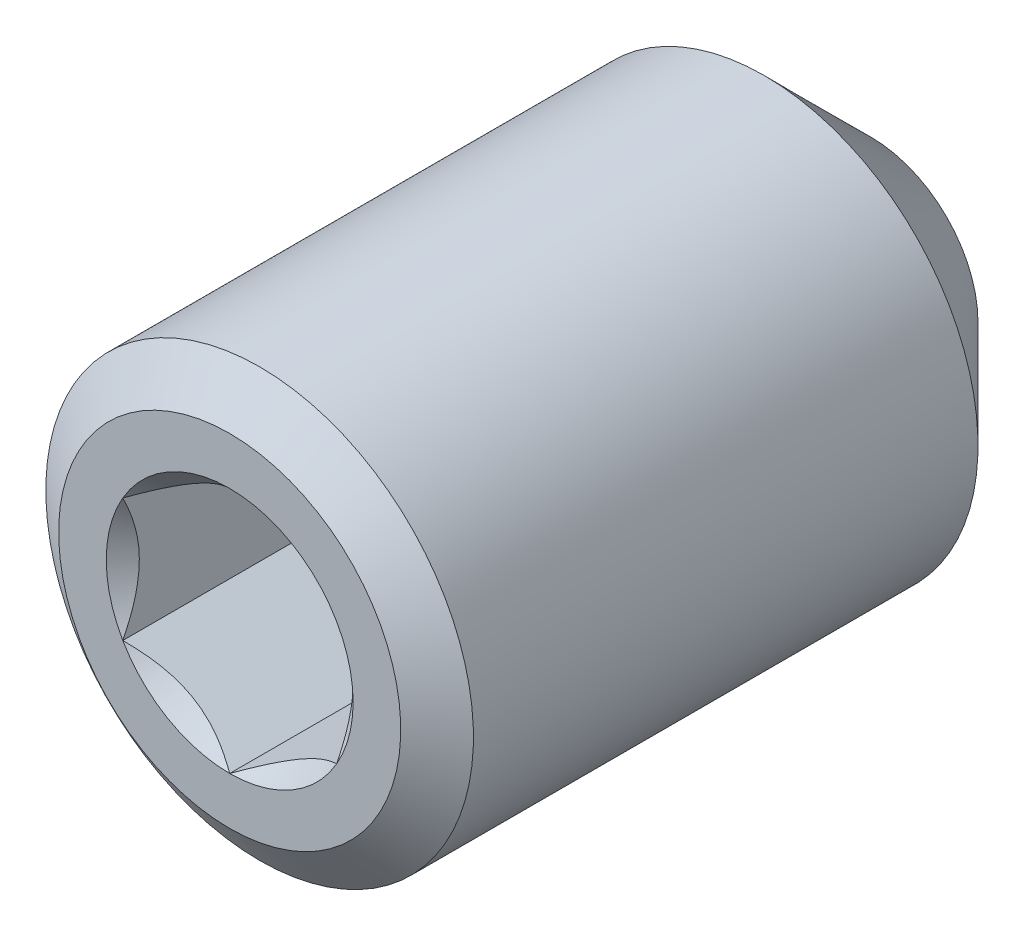
ISO-10303-21;
HEADER;
FILE_DESCRIPTION(('STEP AP214'),'2;1');
FILE_NAME('part.step','',(''),(''),'','','');
FILE_SCHEMA(('AUTOMOTIVE_DESIGN { 1 0 10303 214 1 1 1 1 }'));
ENDSEC;
DATA;
#1=APPLICATION_CONTEXT('core data for automotive mechanical design processes');
#2=APPLICATION_PROTOCOL_DEFINITION('international standard','automotive_design',2000,#1);
#3=PRODUCT_CONTEXT('',#1,'mechanical');
#4=PRODUCT('Part','Part','',(#3));
#5=PRODUCT_RELATED_PRODUCT_CATEGORY('part','',(#4));
#6=PRODUCT_DEFINITION_FORMATION('','',#4);
#7=PRODUCT_DEFINITION_CONTEXT('part definition',#1,'design');
#8=PRODUCT_DEFINITION('design','',#6,#7);
#9=PRODUCT_DEFINITION_SHAPE('','',#8);
#10=(LENGTH_UNIT() NAMED_UNIT(*) SI_UNIT(.MILLI.,.METRE.));
#11=(NAMED_UNIT(*) PLANE_ANGLE_UNIT() SI_UNIT($,.RADIAN.));
#12=(NAMED_UNIT(*) SI_UNIT($,.STERADIAN.) SOLID_ANGLE_UNIT());
#13=UNCERTAINTY_MEASURE_WITH_UNIT(LENGTH_MEASURE(1.E-05),#10,'distance_accuracy_value','');
#14=(GEOMETRIC_REPRESENTATION_CONTEXT(3) GLOBAL_UNCERTAINTY_ASSIGNED_CONTEXT((#13)) GLOBAL_UNIT_ASSIGNED_CONTEXT((#10,
#11,#12)) REPRESENTATION_CONTEXT('',''));
#15=CARTESIAN_POINT('',(0.,0.,0.));
#16=DIRECTION('',(0.,0.,1.));
#17=DIRECTION('',(1.,0.,0.));
#18=AXIS2_PLACEMENT_3D('',#15,#16,#17);
#19=CARTESIAN_POINT('',(-1.,1.73205080756888,4.00000000002296));
#20=DIRECTION('',(0.,0.,1.));
#21=DIRECTION('',(1.,0.,0.));
#22=AXIS2_PLACEMENT_3D('',#19,#20,#21);
#23=PLANE('',#22);
#24=DIRECTION('',(0.866025403784438,-0.5,0.));
#25=VECTOR('',#24,1.);
#26=CARTESIAN_POINT('',(-1.,-0.577350269189623,4.00000000002296));
#27=LINE('',#26,#25);
#28=CARTESIAN_POINT('',(-0.499999999979879,-0.866025403749582,4.00000000000968));
#29=VERTEX_POINT('',#28);
#30=CARTESIAN_POINT('',(0.,-1.15470053837925,4.00000000002296));
#31=VERTEX_POINT('',#30);
#32=EDGE_CURVE('E138',#29,#31,#27,.T.);
#33=ORIENTED_EDGE('',*,*,#32,.T.);
#34=DIRECTION('',(0.866025403784439,0.5,0.));
#35=VECTOR('',#34,1.);
#36=CARTESIAN_POINT('',(0.,-1.15470053837925,4.00000000002296));
#37=LINE('',#36,#35);
#38=CARTESIAN_POINT('',(0.499999999979877,-0.866025403749582,4.00000000000968));
#39=VERTEX_POINT('',#38);
#40=EDGE_CURVE('E137',#31,#39,#37,.T.);
#41=ORIENTED_EDGE('',*,*,#40,.T.);
#42=CARTESIAN_POINT('',(0.,0.,3.9999999999964));
#43=DIRECTION('',(0.,0.,1.));
#44=DIRECTION('',(1.,0.,0.));
#45=AXIS2_PLACEMENT_3D('',#42,#43,#44);
#46=CIRCLE('',#45,0.99999999991951);
#47=EDGE_CURVE('E46',#39,#29,#46,.F.);
#48=ORIENTED_EDGE('',*,*,#47,.T.);
#49=EDGE_LOOP('',(#33,#41,#48));
#50=FACE_BOUND('',#49,.T.);
#51=ADVANCED_FACE('F43',(#50),#23,.T.);
#52=CARTESIAN_POINT('',(-1.,1.73205080756888,4.00000000002296));
#53=DIRECTION('',(0.,0.,1.));
#54=DIRECTION('',(1.,0.,0.));
#55=AXIS2_PLACEMENT_3D('',#52,#53,#54);
#56=PLANE('',#55);
#57=DIRECTION('',(0.866025403784439,0.5,0.));
#58=VECTOR('',#57,1.);
#59=CARTESIAN_POINT('',(0.,-1.15470053837925,4.00000000002296));
#60=LINE('',#59,#58);
#61=CARTESIAN_POINT('',(0.999999999999997,-0.577350269189635,4.00000000002296));
#62=VERTEX_POINT('',#61);
#63=EDGE_CURVE('E144',#39,#62,#60,.T.);
#64=ORIENTED_EDGE('',*,*,#63,.T.);
#65=DIRECTION('',(0.,1.,0.));
#66=VECTOR('',#65,1.);
#67=CARTESIAN_POINT('',(0.999999999999999,-0.577350269189623,4.00000000002296));
#68=LINE('',#67,#66);
#69=CARTESIAN_POINT('',(0.999999999959754,0.,4.00000000000968));
#70=VERTEX_POINT('',#69);
#71=EDGE_CURVE('E150',#62,#70,#68,.T.);
#72=ORIENTED_EDGE('',*,*,#71,.T.);
#73=CARTESIAN_POINT('',(0.,0.,3.9999999999964));
#74=DIRECTION('',(0.,0.,1.));
#75=DIRECTION('',(1.,0.,0.));
#76=AXIS2_PLACEMENT_3D('',#73,#74,#75);
#77=CIRCLE('',#76,0.99999999991951);
#78=EDGE_CURVE('E128',#70,#39,#77,.F.);
#79=ORIENTED_EDGE('',*,*,#78,.T.);
#80=EDGE_LOOP('',(#64,#72,#79));
#81=FACE_BOUND('',#80,.T.);
#82=ADVANCED_FACE('F147',(#81),#56,.T.);
#83=CARTESIAN_POINT('',(0.,-1.15470053837925,4.00000000002296));
#84=DIRECTION('',(0.5,-0.866025403784439,0.));
#85=DIRECTION('',(0.866025403784439,0.5,0.));
#86=AXIS2_PLACEMENT_3D('',#83,#84,#85);
#87=PLANE('',#86);
#88=CARTESIAN_POINT('',(1.00000000000435,-0.577350269187113,6.00000000001723));
#89=CARTESIAN_POINT('',(0.965629464439311,-0.597194107147778,5.980175299703));
#90=CARTESIAN_POINT('',(0.930684324299424,-0.617369693214411,5.96151503364323));
#91=CARTESIAN_POINT('',(0.859427596897569,-0.658509783961444,5.92734887689866));
#92=CARTESIAN_POINT('',(0.823109236817034,-0.679478198930467,5.91186199000083));
#93=CARTESIAN_POINT('',(0.749874902207517,-0.721760061731194,5.88533304036814));
#94=CARTESIAN_POINT('',(0.712977570436177,-0.743062746161756,5.87422431258814));
#95=CARTESIAN_POINT('',(0.638371399377688,-0.786136639105582,5.85710848693828));
#96=CARTESIAN_POINT('',(0.600664836167068,-0.80790653352545,5.85108861987318));
#97=CARTESIAN_POINT('',(0.535672283803156,-0.845430001128075,5.84565888480062));
#98=CARTESIAN_POINT('',(0.508470695023772,-0.861134845732238,5.84485656697926));
#99=CARTESIAN_POINT('',(0.454120291096929,-0.892514066069965,5.84620877981038));
#100=CARTESIAN_POINT('',(0.426971488933477,-0.90818843430721,5.84836396362233));
#101=CARTESIAN_POINT('',(0.345912971863742,-0.954987590957533,5.85912331979131));
#102=CARTESIAN_POINT('',(0.292406762386664,-0.985879415402441,5.87202250831988));
#103=CARTESIAN_POINT('',(0.198537260412748,-1.04007499763578,5.90313768073436));
#104=CARTESIAN_POINT('',(0.157732128752132,-1.06363385138435,5.91971698784645));
#105=CARTESIAN_POINT('',(0.0777188011191276,-1.10982956763202,5.95706128504364));
#106=CARTESIAN_POINT('',(0.0385058936716507,-1.13246915030253,5.97781264969193));
#107=CARTESIAN_POINT('',(-4.37552430664416E-12,-1.15470053838177,6.00000000001725));
#108=B_SPLINE_CURVE_WITH_KNOTS('',3,(#88,#89,#90,#91,#92,#93,#94,#95,#96,#97,#98,#99,#100,#101,
#102,#103,#104,#105,#106,#107),.UNSPECIFIED.,.F.,.F.,(4,2,2,2,2,2,2,2,2,4),(0.,
0.133182946614178,0.267141541533304,0.398973326913963,0.530473323834186,0.624596460624761,
0.718740387704236,0.907081600899055,1.05673041344254,1.20589820621029),.UNSPECIFIED.);
#109=CARTESIAN_POINT('',(1.00000000001205,-0.577350269185189,6.00000000002295));
#110=VERTEX_POINT('',#109);
#111=CARTESIAN_POINT('',(9.86638111688002E-12,-1.15470053838747,6.00000000002295));
#112=VERTEX_POINT('',#111);
#113=EDGE_CURVE('E158',#110,#112,#108,.T.);
#114=ORIENTED_EDGE('',*,*,#113,.F.);
#115=DIRECTION('',(0.,0.,-1.));
#116=VECTOR('',#115,1.);
#117=CARTESIAN_POINT('',(0.999999999999999,-0.577350269189638,4.00000000002296));
#118=LINE('',#117,#116);
#119=EDGE_CURVE('E156',#110,#62,#118,.T.);
#120=ORIENTED_EDGE('',*,*,#119,.T.);
#121=ORIENTED_EDGE('',*,*,#63,.F.);
#122=ORIENTED_EDGE('',*,*,#40,.F.);
#123=DIRECTION('',(0.,0.,1.));
#124=VECTOR('',#123,1.);
#125=CARTESIAN_POINT('',(0.,-1.15470053837925,4.00000000002296));
#126=LINE('',#125,#124);
#127=EDGE_CURVE('E171',#31,#112,#126,.T.);
#128=ORIENTED_EDGE('',*,*,#127,.T.);
#129=EDGE_LOOP('',(#114,#120,#121,#122,#128));
#130=FACE_BOUND('',#129,.T.);
#131=ADVANCED_FACE('F154',(#130),#87,.F.);
#132=CARTESIAN_POINT('',(0.,0.,3.99999999996225));
#133=DIRECTION('',(0.,0.,1.));
#134=DIRECTION('',(1.,0.,0.));
#135=AXIS2_PLACEMENT_3D('',#132,#133,#134);
#136=CONICAL_SURFACE('',#135,0.999999999862666,1.02974425852804);
#137=CARTESIAN_POINT('',(8.5265128291212E-11,0.,3.39913938097424));
#138=VERTEX_POINT('',#137);
#139=VERTEX_LOOP('',#138);
#140=FACE_BOUND('',#139,.T.);
#141=ORIENTED_EDGE('',*,*,#78,.F.);
#142=CARTESIAN_POINT('',(0.,0.,3.9999999999964));
#143=DIRECTION('',(0.,0.,1.));
#144=DIRECTION('',(1.,0.,0.));
#145=AXIS2_PLACEMENT_3D('',#142,#143,#144);
#146=CIRCLE('',#145,0.99999999991951);
#147=CARTESIAN_POINT('',(0.499999999979877,0.86602540374959,4.00000000000968));
#148=VERTEX_POINT('',#147);
#149=EDGE_CURVE('E167',#148,#70,#146,.F.);
#150=ORIENTED_EDGE('',*,*,#149,.F.);
#151=CARTESIAN_POINT('',(0.,0.,3.9999999999964));
#152=DIRECTION('',(0.,0.,1.));
#153=DIRECTION('',(1.,0.,0.));
#154=AXIS2_PLACEMENT_3D('',#151,#152,#153);
#155=CIRCLE('',#154,0.99999999991951);
#156=CARTESIAN_POINT('',(-0.499999999979878,0.86602540374959,4.00000000000968));
#157=VERTEX_POINT('',#156);
#158=EDGE_CURVE('E251',#157,#148,#155,.F.);
#159=ORIENTED_EDGE('',*,*,#158,.F.);
#160=CARTESIAN_POINT('',(0.,0.,3.9999999999964));
#161=DIRECTION('',(0.,0.,1.));
#162=DIRECTION('',(1.,0.,0.));
#163=AXIS2_PLACEMENT_3D('',#160,#161,#162);
#164=CIRCLE('',#163,0.99999999991951);
#165=CARTESIAN_POINT('',(-0.999999999959755,0.,4.00000000000968));
#166=VERTEX_POINT('',#165);
#167=EDGE_CURVE('E295',#166,#157,#164,.F.);
#168=ORIENTED_EDGE('',*,*,#167,.F.);
#169=CARTESIAN_POINT('',(0.,0.,3.9999999999964));
#170=DIRECTION('',(0.,0.,1.));
#171=DIRECTION('',(1.,0.,0.));
#172=AXIS2_PLACEMENT_3D('',#169,#170,#171);
#173=CIRCLE('',#172,0.99999999991951);
#174=EDGE_CURVE('E131',#29,#166,#173,.F.);
#175=ORIENTED_EDGE('',*,*,#174,.F.);
#176=ORIENTED_EDGE('',*,*,#47,.F.);
#177=EDGE_LOOP('',(#141,#150,#159,#168,#175,#176));
#178=FACE_BOUND('',#177,.T.);
#179=ADVANCED_FACE('F126',(#140,#178),#136,.F.);
#180=CARTESIAN_POINT('',(-1.,1.73205080756888,4.00000000002296));
#181=DIRECTION('',(0.,0.,1.));
#182=DIRECTION('',(1.,0.,0.));
#183=AXIS2_PLACEMENT_3D('',#180,#181,#182);
#184=PLANE('',#183);
#185=DIRECTION('',(0.,1.,0.));
#186=VECTOR('',#185,1.);
#187=CARTESIAN_POINT('',(-1.,0.577350269189631,4.00000000002296));
#188=LINE('',#187,#186);
#189=CARTESIAN_POINT('',(-1.,-0.577350269189622,4.00000000002296));
#190=VERTEX_POINT('',#189);
#191=EDGE_CURVE('E164',#166,#190,#188,.F.);
#192=ORIENTED_EDGE('',*,*,#191,.T.);
#193=DIRECTION('',(0.866025403784438,-0.5,0.));
#194=VECTOR('',#193,1.);
#195=CARTESIAN_POINT('',(-1.,-0.577350269189623,4.00000000002296));
#196=LINE('',#195,#194);
#197=EDGE_CURVE('E172',#190,#29,#196,.T.);
#198=ORIENTED_EDGE('',*,*,#197,.T.);
#199=ORIENTED_EDGE('',*,*,#174,.T.);
#200=EDGE_LOOP('',(#192,#198,#199));
#201=FACE_BOUND('',#200,.T.);
#202=ADVANCED_FACE('F270',(#201),#184,.T.);
#203=CARTESIAN_POINT('',(-1.,-0.577350269189623,4.00000000002296));
#204=DIRECTION('',(-0.5,-0.866025403784438,0.));
#205=DIRECTION('',(0.866025403784438,-0.5,0.));
#206=AXIS2_PLACEMENT_3D('',#203,#204,#205);
#207=PLANE('',#206);
#208=CARTESIAN_POINT('',(4.34406010216377E-12,-1.15470053838176,6.00000000001723));
#209=CARTESIAN_POINT('',(-0.0343705355606918,-1.13485670042109,5.980175299703));
#210=CARTESIAN_POINT('',(-0.0693156757005793,-1.11468111435446,5.96151503364323));
#211=CARTESIAN_POINT('',(-0.140572403102434,-1.07354102360743,5.92734887689866));
#212=CARTESIAN_POINT('',(-0.176890763182968,-1.0525726086384,5.91186199000083));
#213=CARTESIAN_POINT('',(-0.250125097792485,-1.01029074583768,5.88533304036814));
#214=CARTESIAN_POINT('',(-0.287022429563825,-0.988988061407114,5.87422431258814));
#215=CARTESIAN_POINT('',(-0.361628600622314,-0.945914168463289,5.85710848693828));
#216=CARTESIAN_POINT('',(-0.399335163832935,-0.924144274043421,5.85108861987318));
#217=CARTESIAN_POINT('',(-0.464327716196846,-0.886620806440796,5.84565888480062));
#218=CARTESIAN_POINT('',(-0.491529304976231,-0.870915961836633,5.84485656697926));
#219=CARTESIAN_POINT('',(-0.545879708903073,-0.839536741498905,5.84620877981038));
#220=CARTESIAN_POINT('',(-0.573028511066526,-0.82386237326166,5.84836396362233));
#221=CARTESIAN_POINT('',(-0.65408702813626,-0.777063216611337,5.85912331979131));
#222=CARTESIAN_POINT('',(-0.707593237613339,-0.746171392166429,5.87202250831988));
#223=CARTESIAN_POINT('',(-0.801462739587254,-0.691975809933093,5.90313768073436));
#224=CARTESIAN_POINT('',(-0.84226787124787,-0.668416956184518,5.91971698784645));
#225=CARTESIAN_POINT('',(-0.922281198880873,-0.622221239936846,5.95706128504364));
#226=CARTESIAN_POINT('',(-0.96149410632835,-0.599581657266337,5.97781264969193));
#227=CARTESIAN_POINT('',(-1.00000000000438,-0.577350269187097,6.00000000001725));
#228=B_SPLINE_CURVE_WITH_KNOTS('',3,(#208,#209,#210,#211,#212,#213,#214,#215,#216,#217,#218,
#219,#220,#221,#222,#223,#224,#225,#226,#227),.UNSPECIFIED.,.F.,.F.,(4,2,2,2,2,2,2,2,2,4),(0.,
0.133182946614178,0.267141541533303,0.398973326913961,0.530473323834185,0.62459646062476,
0.718740387704235,0.907081600899054,1.05673041344254,1.20589820621028),.UNSPECIFIED.);
#229=CARTESIAN_POINT('',(-1.00000000000219,-0.577350269202279,6.00000000002295));
#230=VERTEX_POINT('',#229);
#231=EDGE_CURVE('E273',#112,#230,#228,.T.);
#232=ORIENTED_EDGE('',*,*,#231,.F.);
#233=ORIENTED_EDGE('',*,*,#127,.F.);
#234=ORIENTED_EDGE('',*,*,#32,.F.);
#235=ORIENTED_EDGE('',*,*,#197,.F.);
#236=DIRECTION('',(0.,0.,1.));
#237=VECTOR('',#236,1.);
#238=CARTESIAN_POINT('',(-1.,-0.577350269189623,4.00000000002296));
#239=LINE('',#238,#237);
#240=EDGE_CURVE('E294',#190,#230,#239,.T.);
#241=ORIENTED_EDGE('',*,*,#240,.T.);
#242=EDGE_LOOP('',(#232,#233,#234,#235,#241));
#243=FACE_BOUND('',#242,.T.);
#244=ADVANCED_FACE('F265',(#243),#207,.F.);
#245=CARTESIAN_POINT('',(-1.,1.73205080756888,4.00000000002296));
#246=DIRECTION('',(0.,0.,1.));
#247=DIRECTION('',(1.,0.,0.));
#248=AXIS2_PLACEMENT_3D('',#245,#246,#247);
#249=PLANE('',#248);
#250=DIRECTION('',(0.,1.,0.));
#251=VECTOR('',#250,1.);
#252=CARTESIAN_POINT('',(0.999999999999999,-0.577350269189623,4.00000000002296));
#253=LINE('',#252,#251);
#254=CARTESIAN_POINT('',(1.00000000000001,0.577350269189624,4.00000000002296));
#255=VERTEX_POINT('',#254);
#256=EDGE_CURVE('E166',#70,#255,#253,.T.);
#257=ORIENTED_EDGE('',*,*,#256,.T.);
#258=DIRECTION('',(-0.866025403784439,0.5,0.));
#259=VECTOR('',#258,1.);
#260=CARTESIAN_POINT('',(0.999999999999999,0.577350269189632,4.00000000002296));
#261=LINE('',#260,#259);
#262=EDGE_CURVE('E293',#255,#148,#261,.T.);
#263=ORIENTED_EDGE('',*,*,#262,.T.);
#264=ORIENTED_EDGE('',*,*,#149,.T.);
#265=EDGE_LOOP('',(#257,#263,#264));
#266=FACE_BOUND('',#265,.T.);
#267=ADVANCED_FACE('F260',(#266),#249,.T.);
#268=CARTESIAN_POINT('',(0.999999999999999,-0.577350269189623,4.00000000002296));
#269=DIRECTION('',(1.,0.,0.));
#270=DIRECTION('',(0.,0.,-1.));
#271=AXIS2_PLACEMENT_3D('',#268,#269,#270);
#272=PLANE('',#271);
#273=CARTESIAN_POINT('',(0.999999999999999,0.577350269194653,6.00000000001723));
#274=CARTESIAN_POINT('',(1.00000000000028,0.537921916676446,5.98030421855977));
#275=CARTESIAN_POINT('',(1.00000000000014,0.49783852291972,5.9617584765621));
#276=CARTESIAN_POINT('',(0.99999999999986,0.416089217995143,5.92776375689529));
#277=CARTESIAN_POINT('',(0.999999999999719,0.374414806902046,5.9123354006669));
#278=CARTESIAN_POINT('',(1.00000000000028,0.289861522872848,5.88569394541181));
#279=CARTESIAN_POINT('',(1.00000000000097,0.246987267529237,5.87446658061539));
#280=CARTESIAN_POINT('',(0.999999999999026,0.160298880503457,5.85718156716053));
#281=CARTESIAN_POINT('',(0.999999999996392,0.116488090626602,5.85110793192481));
#282=CARTESIAN_POINT('',(1.00000000000099,0.0604313808570414,5.84705063446644));
#283=CARTESIAN_POINT('',(1.00000000000245,0.0483511655843552,5.84639469641996));
#284=CARTESIAN_POINT('',(0.999999999997552,0.0241811978039131,5.84551903064673));
#285=CARTESIAN_POINT('',(0.9999999999912,0.0120914540519865,5.84529906595775));
#286=CARTESIAN_POINT('',(0.999999999980812,-0.0303471731685641,5.8453004549242));
#287=CARTESIAN_POINT('',(0.999999999994745,-0.0607051197111141,5.84668952347427));
#288=CARTESIAN_POINT('',(1.00000000000526,-0.121184237369848,5.8521633014867));
#289=CARTESIAN_POINT('',(1.00000000000182,-0.151305228502509,5.85624989109396));
#290=CARTESIAN_POINT('',(0.999999999996333,-0.241266773106714,5.8723004621711));
#291=CARTESIAN_POINT('',(0.999999999999146,-0.300451693372223,5.88805252347473));
#292=CARTESIAN_POINT('',(1.00000000000056,-0.396054922851176,5.92027718353131));
#293=CARTESIAN_POINT('',(1.00000000000028,-0.433252086896398,5.93460640142183));
#294=CARTESIAN_POINT('',(0.999999999999724,-0.506237961684511,5.96566243987014));
#295=CARTESIAN_POINT('',(0.999999999999452,-0.542036442998918,5.98236613195488));
#296=CARTESIAN_POINT('',(0.999999999999999,-0.577350269194674,6.00000000001725));
#297=B_SPLINE_CURVE_WITH_KNOTS('',3,(#273,#274,#275,#276,#277,#278,#279,#280,#281,#282,#283,
#284,#285,#286,#287,#288,#289,#290,#291,#292,#293,#294,#295,#296),.UNSPECIFIED.,.F.,.F.,(4,2,2,
2,2,2,2,2,2,2,2,4),(0.,0.132313199493045,0.265474890536747,0.398180195022123,0.530472334478834,
0.566760915583217,0.603029767536941,0.69405745751806,0.78514865996614,0.968083578449671,
1.08759246660903,1.20600826492851),.UNSPECIFIED.);
#298=CARTESIAN_POINT('',(1.00000000000219,0.577350269202289,6.00000000002295));
#299=VERTEX_POINT('',#298);
#300=EDGE_CURVE('E242',#299,#110,#297,.T.);
#301=ORIENTED_EDGE('',*,*,#300,.F.);
#302=DIRECTION('',(0.,0.,1.));
#303=VECTOR('',#302,1.);
#304=CARTESIAN_POINT('',(1.00000000000001,0.577350269189624,4.00000000002296));
#305=LINE('',#304,#303);
#306=EDGE_CURVE('E350',#299,#255,#305,.F.);
#307=ORIENTED_EDGE('',*,*,#306,.T.);
#308=ORIENTED_EDGE('',*,*,#256,.F.);
#309=ORIENTED_EDGE('',*,*,#71,.F.);
#310=ORIENTED_EDGE('',*,*,#119,.F.);
#311=EDGE_LOOP('',(#301,#307,#308,#309,#310));
#312=FACE_BOUND('',#311,.T.);
#313=ADVANCED_FACE('F254',(#312),#272,.F.);
#314=CARTESIAN_POINT('',(-1.,1.73205080756888,4.00000000002296));
#315=DIRECTION('',(0.,0.,1.));
#316=DIRECTION('',(1.,0.,0.));
#317=AXIS2_PLACEMENT_3D('',#314,#315,#316);
#318=PLANE('',#317);
#319=DIRECTION('',(-0.866025403784439,0.5,0.));
#320=VECTOR('',#319,1.);
#321=CARTESIAN_POINT('',(0.999999999999999,0.577350269189632,4.00000000002296));
#322=LINE('',#321,#320);
#323=CARTESIAN_POINT('',(0.,1.15470053837926,4.00000000002296));
#324=VERTEX_POINT('',#323);
#325=EDGE_CURVE('E354',#148,#324,#322,.T.);
#326=ORIENTED_EDGE('',*,*,#325,.T.);
#327=DIRECTION('',(-0.866025403784439,-0.5,0.));
#328=VECTOR('',#327,1.);
#329=CARTESIAN_POINT('',(0.,1.15470053837926,4.00000000002296));
#330=LINE('',#329,#328);
#331=EDGE_CURVE('E353',#324,#157,#330,.T.);
#332=ORIENTED_EDGE('',*,*,#331,.T.);
#333=ORIENTED_EDGE('',*,*,#158,.T.);
#334=EDGE_LOOP('',(#326,#332,#333));
#335=FACE_BOUND('',#334,.T.);
#336=ADVANCED_FACE('F259',(#335),#318,.T.);
#337=CARTESIAN_POINT('',(-1.,1.73205080756888,4.00000000002296));
#338=DIRECTION('',(0.,0.,1.));
#339=DIRECTION('',(1.,0.,0.));
#340=AXIS2_PLACEMENT_3D('',#337,#338,#339);
#341=PLANE('',#340);
#342=DIRECTION('',(-0.866025403784439,-0.5,0.));
#343=VECTOR('',#342,1.);
#344=CARTESIAN_POINT('',(0.,1.15470053837926,4.00000000002296));
#345=LINE('',#344,#343);
#346=CARTESIAN_POINT('',(-1.,0.577350269189631,4.00000000002296));
#347=VERTEX_POINT('',#346);
#348=EDGE_CURVE('E349',#157,#347,#345,.T.);
#349=ORIENTED_EDGE('',*,*,#348,.T.);
#350=DIRECTION('',(0.,1.,0.));
#351=VECTOR('',#350,1.);
#352=CARTESIAN_POINT('',(-1.,0.577350269189631,4.00000000002296));
#353=LINE('',#352,#351);
#354=EDGE_CURVE('E361',#347,#166,#353,.F.);
#355=ORIENTED_EDGE('',*,*,#354,.T.);
#356=ORIENTED_EDGE('',*,*,#167,.T.);
#357=EDGE_LOOP('',(#349,#355,#356));
#358=FACE_BOUND('',#357,.T.);
#359=ADVANCED_FACE('F300',(#358),#341,.T.);
#360=CARTESIAN_POINT('',(-1.,0.577350269189631,4.00000000002296));
#361=DIRECTION('',(-1.,0.,0.));
#362=DIRECTION('',(0.,0.,1.));
#363=AXIS2_PLACEMENT_3D('',#360,#361,#362);
#364=PLANE('',#363);
#365=CARTESIAN_POINT('',(-1.,-0.57735026919464,6.00000000001723));
#366=CARTESIAN_POINT('',(-1.,-0.537662593273297,5.980175299703));
#367=CARTESIAN_POINT('',(-1.,-0.497311421140017,5.96151503364324));
#368=CARTESIAN_POINT('',(-1.,-0.415031239645926,5.92734887689866));
#369=CARTESIAN_POINT('',(-1.,-0.373094409707868,5.91186199000084));
#370=CARTESIAN_POINT('',(-1.,-0.288530684106389,5.88533304036816));
#371=CARTESIAN_POINT('',(-1.,-0.245925315245254,5.87422431258817));
#372=CARTESIAN_POINT('',(-1.,-0.159777529357581,5.85710848693831));
#373=CARTESIAN_POINT('',(-1.,-0.116237740517836,5.85108861987322));
#374=CARTESIAN_POINT('',(-1.,-0.0411908053125612,5.84565888480067));
#375=CARTESIAN_POINT('',(-1.,-0.00978111610422053,5.84485656697931));
#376=CARTESIAN_POINT('',(-1.,0.0529773245712627,5.84620877981044));
#377=CARTESIAN_POINT('',(-1.,0.0843260610457673,5.84836396362241));
#378=CARTESIAN_POINT('',(-1.,0.177924374346455,5.8591233197914));
#379=CARTESIAN_POINT('',(-1.,0.239708023236298,5.87202250831999));
#380=CARTESIAN_POINT('',(-1.,0.348099187703098,5.90313768073452));
#381=CARTESIAN_POINT('',(-1.,0.395216895200345,5.91971698784667));
#382=CARTESIAN_POINT('',(-1.,0.487608327695878,5.95706128504396));
#383=CARTESIAN_POINT('',(-1.,0.532887493036986,5.9778126496923));
#384=CARTESIAN_POINT('',(-1.,0.577350269195555,6.00000000001769));
#385=B_SPLINE_CURVE_WITH_KNOTS('',3,(#365,#366,#367,#368,#369,#370,#371,#372,#373,#374,#375,
#376,#377,#378,#379,#380,#381,#382,#383,#384),.UNSPECIFIED.,.F.,.F.,(4,2,2,2,2,2,2,2,2,4),(0.,
0.133182946614212,0.267141541533371,0.398973326914058,0.530473323834309,0.624596460624927,
0.718740387704445,0.907081600899354,1.05673041344316,1.20589820621123),.UNSPECIFIED.);
#386=CARTESIAN_POINT('',(-1.00000000000602,0.577350269193123,6.00000000002168));
#387=VERTEX_POINT('',#386);
#388=EDGE_CURVE('E287',#230,#387,#385,.T.);
#389=ORIENTED_EDGE('',*,*,#388,.F.);
#390=ORIENTED_EDGE('',*,*,#240,.F.);
#391=ORIENTED_EDGE('',*,*,#191,.F.);
#392=ORIENTED_EDGE('',*,*,#354,.F.);
#393=DIRECTION('',(0.,0.,1.));
#394=VECTOR('',#393,1.);
#395=CARTESIAN_POINT('',(-1.,0.577350269189631,4.00000000002296));
#396=LINE('',#395,#394);
#397=EDGE_CURVE('E345',#347,#387,#396,.T.);
#398=ORIENTED_EDGE('',*,*,#397,.T.);
#399=EDGE_LOOP('',(#389,#390,#391,#392,#398));
#400=FACE_BOUND('',#399,.T.);
#401=ADVANCED_FACE('F296',(#400),#364,.F.);
#402=CARTESIAN_POINT('',(0.999999999999999,0.577350269189632,4.00000000002296));
#403=DIRECTION('',(0.5,0.866025403784439,0.));
#404=DIRECTION('',(-0.866025403784439,0.5,0.));
#405=AXIS2_PLACEMENT_3D('',#402,#403,#404);
#406=PLANE('',#405);
#407=CARTESIAN_POINT('',(-5.11922019557825E-12,1.15470053838221,6.00000000001768));
#408=CARTESIAN_POINT('',(0.0343705355599627,1.13485670042152,5.98017529970339));
#409=CARTESIAN_POINT('',(0.0693156756998975,1.11468111435486,5.96151503364358));
#410=CARTESIAN_POINT('',(0.140572403101851,1.07354102360777,5.92734887689891));
#411=CARTESIAN_POINT('',(0.176890763182437,1.05257260863872,5.91186199000104));
#412=CARTESIAN_POINT('',(0.250125097792061,1.01029074583793,5.88533304036828));
#413=CARTESIAN_POINT('',(0.287022429563455,0.988988061407336,5.87422431258824));
#414=CARTESIAN_POINT('',(0.361628600622057,0.945914168463444,5.85710848693833));
#415=CARTESIAN_POINT('',(0.399335163832735,0.924144274043544,5.85108861987321));
#416=CARTESIAN_POINT('',(0.464327716196708,0.886620806440883,5.84565888480063));
#417=CARTESIAN_POINT('',(0.491529304976095,0.870915961836718,5.84485656697926));
#418=CARTESIAN_POINT('',(0.545879708902943,0.839536741498988,5.84620877981037));
#419=CARTESIAN_POINT('',(0.573028511066399,0.823862373261741,5.84836396362232));
#420=CARTESIAN_POINT('',(0.654087028136141,0.777063216611413,5.85912331979129));
#421=CARTESIAN_POINT('',(0.707593237613226,0.746171392166502,5.87202250831985));
#422=CARTESIAN_POINT('',(0.801462739587165,0.691975809933152,5.90313768073432));
#423=CARTESIAN_POINT('',(0.842267871247799,0.668416956184567,5.91971698784642));
#424=CARTESIAN_POINT('',(0.922281198880837,0.622221239936875,5.95706128504362));
#425=CARTESIAN_POINT('',(0.961494106328331,0.599581657266356,5.97781264969192));
#426=CARTESIAN_POINT('',(1.00000000000437,0.577350269187106,6.00000000001725));
#427=B_SPLINE_CURVE_WITH_KNOTS('',3,(#407,#408,#409,#410,#411,#412,#413,#414,#415,#416,#417,
#418,#419,#420,#421,#422,#423,#424,#425,#426),.UNSPECIFIED.,.F.,.F.,(4,2,2,2,2,2,2,2,2,4),(0.,
0.133182946614387,0.267141541533725,0.398973326914592,0.530473323835022,0.624596460625606,
0.71874038770509,0.907081600899925,1.05673041344347,1.20589820621128),.UNSPECIFIED.);
#428=CARTESIAN_POINT('',(9.493716888234E-12,1.15470053838769,6.00000000002316));
#429=VERTEX_POINT('',#428);
#430=EDGE_CURVE('E211',#429,#299,#427,.T.);
#431=ORIENTED_EDGE('',*,*,#430,.F.);
#432=DIRECTION('',(0.,0.,1.));
#433=VECTOR('',#432,1.);
#434=CARTESIAN_POINT('',(0.,1.15470053837926,4.00000000002296));
#435=LINE('',#434,#433);
#436=EDGE_CURVE('E210',#429,#324,#435,.F.);
#437=ORIENTED_EDGE('',*,*,#436,.T.);
#438=ORIENTED_EDGE('',*,*,#325,.F.);
#439=ORIENTED_EDGE('',*,*,#262,.F.);
#440=ORIENTED_EDGE('',*,*,#306,.F.);
#441=EDGE_LOOP('',(#431,#437,#438,#439,#440));
#442=FACE_BOUND('',#441,.T.);
#443=ADVANCED_FACE('F299',(#442),#406,.F.);
#444=CARTESIAN_POINT('',(0.,1.15470053837926,4.00000000002296));
#445=DIRECTION('',(-0.5,0.866025403784439,0.));
#446=DIRECTION('',(-0.866025403784439,-0.5,0.));
#447=AXIS2_PLACEMENT_3D('',#444,#445,#446);
#448=PLANE('',#447);
#449=CARTESIAN_POINT('',(5.11763188215041E-12,1.15470053838221,6.00000000001768));
#450=CARTESIAN_POINT('',(-0.0343705355599649,1.13485670042152,5.98017529970339));
#451=CARTESIAN_POINT('',(-0.0693156756999002,1.11468111435486,5.96151503364358));
#452=CARTESIAN_POINT('',(-0.140572403101855,1.07354102360777,5.92734887689891));
#453=CARTESIAN_POINT('',(-0.176890763182442,1.05257260863872,5.91186199000104));
#454=CARTESIAN_POINT('',(-0.250125097792066,1.01029074583793,5.88533304036827));
#455=CARTESIAN_POINT('',(-0.287022429563459,0.988988061407334,5.87422431258824));
#456=CARTESIAN_POINT('',(-0.36162860062206,0.945914168463444,5.85710848693833));
#457=CARTESIAN_POINT('',(-0.399335163832737,0.924144274043543,5.85108861987321));
#458=CARTESIAN_POINT('',(-0.464327716196709,0.886620806440883,5.84565888480063));
#459=CARTESIAN_POINT('',(-0.491529304976095,0.870915961836719,5.84485656697926));
#460=CARTESIAN_POINT('',(-0.545879708902943,0.839536741498989,5.84620877981037));
#461=CARTESIAN_POINT('',(-0.573028511066398,0.823862373261742,5.84836396362232));
#462=CARTESIAN_POINT('',(-0.654087028136141,0.777063216611414,5.85912331979129));
#463=CARTESIAN_POINT('',(-0.707593237613226,0.746171392166502,5.87202250831985));
#464=CARTESIAN_POINT('',(-0.801462739587297,0.691975809933076,5.90313768073437));
#465=CARTESIAN_POINT('',(-0.842267871248056,0.668416956184419,5.91971698784653));
#466=CARTESIAN_POINT('',(-0.922281198881337,0.622221239936587,5.95706128504387));
#467=CARTESIAN_POINT('',(-0.961494106328947,0.599581657266001,5.97781264969225));
#468=CARTESIAN_POINT('',(-1.0000000000051,0.577350269186686,6.00000000001767));
#469=B_SPLINE_CURVE_WITH_KNOTS('',3,(#449,#450,#451,#452,#453,#454,#455,#456,#457,#458,#459,
#460,#461,#462,#463,#464,#465,#466,#467,#468),.UNSPECIFIED.,.F.,.F.,(4,2,2,2,2,2,2,2,2,4),(0.,
0.133182946614389,0.26714154153373,0.398973326914595,0.530473323835021,0.624596460625605,
0.718740387705087,0.907081600899924,1.05673041344394,1.20589820621222),.UNSPECIFIED.);
#470=EDGE_CURVE('E201',#429,#387,#469,.T.);
#471=ORIENTED_EDGE('',*,*,#470,.T.);
#472=ORIENTED_EDGE('',*,*,#397,.F.);
#473=ORIENTED_EDGE('',*,*,#348,.F.);
#474=ORIENTED_EDGE('',*,*,#331,.F.);
#475=ORIENTED_EDGE('',*,*,#436,.F.);
#476=EDGE_LOOP('',(#471,#472,#473,#474,#475));
#477=FACE_BOUND('',#476,.T.);
#478=ADVANCED_FACE('F218',(#477),#448,.F.);
#479=CARTESIAN_POINT('',(0.,0.,6.00000000002864));
#480=DIRECTION('',(0.,0.,1.));
#481=DIRECTION('',(1.,0.,0.));
#482=AXIS2_PLACEMENT_3D('',#479,#480,#481);
#483=CONICAL_SURFACE('',#482,1.15470053839317,0.785398163580063);
#484=ORIENTED_EDGE('',*,*,#388,.T.);
#485=CARTESIAN_POINT('',(0.,0.,6.00000000002864));
#486=DIRECTION('',(0.,0.,1.));
#487=DIRECTION('',(1.,0.,0.));
#488=AXIS2_PLACEMENT_3D('',#485,#486,#487);
#489=CIRCLE('',#488,1.15470053839317);
#490=EDGE_CURVE('E197',#387,#230,#489,.T.);
#491=ORIENTED_EDGE('',*,*,#490,.T.);
#492=EDGE_LOOP('',(#484,#491));
#493=FACE_BOUND('',#492,.T.);
#494=ADVANCED_FACE('F282',(#493),#483,.F.);
#495=CARTESIAN_POINT('',(0.,0.,6.00000000002864));
#496=DIRECTION('',(0.,0.,1.));
#497=DIRECTION('',(1.,0.,0.));
#498=AXIS2_PLACEMENT_3D('',#495,#496,#497);
#499=CONICAL_SURFACE('',#498,1.15470053839317,0.785398163579885);
#500=ORIENTED_EDGE('',*,*,#231,.T.);
#501=CARTESIAN_POINT('',(0.,0.,6.00000000002864));
#502=DIRECTION('',(0.,0.,1.));
#503=DIRECTION('',(1.,0.,0.));
#504=AXIS2_PLACEMENT_3D('',#501,#502,#503);
#505=CIRCLE('',#504,1.15470053839317);
#506=EDGE_CURVE('E193',#230,#112,#505,.T.);
#507=ORIENTED_EDGE('',*,*,#506,.T.);
#508=EDGE_LOOP('',(#500,#507));
#509=FACE_BOUND('',#508,.T.);
#510=ADVANCED_FACE('F279',(#509),#499,.F.);
#511=CARTESIAN_POINT('',(0.,0.,6.00000000002864));
#512=DIRECTION('',(0.,0.,1.));
#513=DIRECTION('',(1.,0.,0.));
#514=AXIS2_PLACEMENT_3D('',#511,#512,#513);
#515=CONICAL_SURFACE('',#514,1.15470053839317,0.785398163579885);
#516=ORIENTED_EDGE('',*,*,#113,.T.);
#517=CARTESIAN_POINT('',(0.,0.,6.00000000002864));
#518=DIRECTION('',(0.,0.,1.));
#519=DIRECTION('',(1.,0.,0.));
#520=AXIS2_PLACEMENT_3D('',#517,#518,#519);
#521=CIRCLE('',#520,1.15470053839317);
#522=EDGE_CURVE('E189',#112,#110,#521,.T.);
#523=ORIENTED_EDGE('',*,*,#522,.T.);
#524=EDGE_LOOP('',(#516,#523));
#525=FACE_BOUND('',#524,.T.);
#526=ADVANCED_FACE('F237',(#525),#515,.F.);
#527=CARTESIAN_POINT('',(0.,0.,6.00000000002864));
#528=DIRECTION('',(0.,0.,1.));
#529=DIRECTION('',(1.,0.,0.));
#530=AXIS2_PLACEMENT_3D('',#527,#528,#529);
#531=CONICAL_SURFACE('',#530,1.15470053839317,0.785398163580073);
#532=CARTESIAN_POINT('',(0.,0.,6.00000000002864));
#533=DIRECTION('',(0.,0.,1.));
#534=DIRECTION('',(1.,0.,0.));
#535=AXIS2_PLACEMENT_3D('',#532,#533,#534);
#536=CIRCLE('',#535,1.15470053839317);
#537=EDGE_CURVE('E185',#110,#299,#536,.T.);
#538=ORIENTED_EDGE('',*,*,#537,.T.);
#539=ORIENTED_EDGE('',*,*,#300,.T.);
#540=EDGE_LOOP('',(#538,#539));
#541=FACE_BOUND('',#540,.T.);
#542=ADVANCED_FACE('F232',(#541),#531,.F.);
#543=CARTESIAN_POINT('',(0.,0.,6.00000000002864));
#544=DIRECTION('',(0.,0.,1.));
#545=DIRECTION('',(1.,0.,0.));
#546=AXIS2_PLACEMENT_3D('',#543,#544,#545);
#547=CONICAL_SURFACE('',#546,1.15470053839317,0.785398163579885);
#548=ORIENTED_EDGE('',*,*,#430,.T.);
#549=CARTESIAN_POINT('',(0.,0.,6.00000000002864));
#550=DIRECTION('',(0.,0.,1.));
#551=DIRECTION('',(1.,0.,0.));
#552=AXIS2_PLACEMENT_3D('',#549,#550,#551);
#553=CIRCLE('',#552,1.15470053839317);
#554=EDGE_CURVE('E182',#299,#429,#553,.T.);
#555=ORIENTED_EDGE('',*,*,#554,.T.);
#556=EDGE_LOOP('',(#548,#555));
#557=FACE_BOUND('',#556,.T.);
#558=ADVANCED_FACE('F226',(#557),#547,.F.);
#559=CARTESIAN_POINT('',(0.,0.,6.00000000002864));
#560=DIRECTION('',(0.,0.,1.));
#561=DIRECTION('',(1.,0.,0.));
#562=AXIS2_PLACEMENT_3D('',#559,#560,#561);
#563=CONICAL_SURFACE('',#562,1.15470053839317,0.785398163579885);
#564=ORIENTED_EDGE('',*,*,#470,.F.);
#565=CARTESIAN_POINT('',(0.,0.,6.00000000002864));
#566=DIRECTION('',(0.,0.,1.));
#567=DIRECTION('',(1.,0.,0.));
#568=AXIS2_PLACEMENT_3D('',#565,#566,#567);
#569=CIRCLE('',#568,1.15470053839317);
#570=EDGE_CURVE('E178',#429,#387,#569,.T.);
#571=ORIENTED_EDGE('',*,*,#570,.T.);
#572=EDGE_LOOP('',(#564,#571));
#573=FACE_BOUND('',#572,.T.);
#574=ADVANCED_FACE('F221',(#573),#563,.F.);
#575=CARTESIAN_POINT('',(0.,0.,6.00000000002296));
#576=DIRECTION('',(0.,0.,-1.));
#577=DIRECTION('',(0.,1.,0.));
#578=AXIS2_PLACEMENT_3D('',#575,#576,#577);
#579=PLANE('',#578);
#580=CARTESIAN_POINT('',(0.,0.,6.0000000000059));
#581=DIRECTION('',(0.,0.,-1.));
#582=DIRECTION('',(0.,1.,0.));
#583=AXIS2_PLACEMENT_3D('',#580,#581,#582);
#584=CIRCLE('',#583,1.59999999999627);
#585=CARTESIAN_POINT('',(0.,1.59999999999625,6.00000000000591));
#586=VERTEX_POINT('',#585);
#587=EDGE_CURVE('E173',#586,#586,#584,.T.);
#588=ORIENTED_EDGE('',*,*,#587,.F.);
#589=EDGE_LOOP('',(#588));
#590=FACE_BOUND('',#589,.T.);
#591=ORIENTED_EDGE('',*,*,#554,.F.);
#592=ORIENTED_EDGE('',*,*,#537,.F.);
#593=ORIENTED_EDGE('',*,*,#522,.F.);
#594=ORIENTED_EDGE('',*,*,#506,.F.);
#595=ORIENTED_EDGE('',*,*,#490,.F.);
#596=ORIENTED_EDGE('',*,*,#570,.F.);
#597=EDGE_LOOP('',(#591,#592,#593,#594,#595,#596));
#598=FACE_BOUND('',#597,.T.);
#599=ADVANCED_FACE('F225',(#590,#598),#579,.F.);
#600=CARTESIAN_POINT('',(0.,0.,5.71991698473083));
#601=DIRECTION('',(0.,0.,-1.));
#602=DIRECTION('',(0.,1.,0.));
#603=AXIS2_PLACEMENT_3D('',#600,#601,#602);
#604=CONICAL_SURFACE('',#603,2.00000000000958,0.959931088627301);
#605=CARTESIAN_POINT('',(0.,0.,5.71991698473907));
#606=DIRECTION('',(0.,0.,1.));
#607=DIRECTION('',(0.,-1.,0.));
#608=AXIS2_PLACEMENT_3D('',#605,#606,#607);
#609=CIRCLE('',#608,2.00000000000002);
#610=CARTESIAN_POINT('',(0.,-2.00000000000004,5.71991698473906));
#611=VERTEX_POINT('',#610);
#612=EDGE_CURVE('E177',#611,#611,#609,.F.);
#613=ORIENTED_EDGE('',*,*,#612,.F.);
#614=EDGE_LOOP('',(#613));
#615=FACE_BOUND('',#614,.T.);
#616=ORIENTED_EDGE('',*,*,#587,.T.);
#617=EDGE_LOOP('',(#616));
#618=FACE_BOUND('',#617,.T.);
#619=ADVANCED_FACE('F309',(#615,#618),#604,.T.);
#620=CARTESIAN_POINT('',(0.,0.,2.35245850577215E-11));
#621=DIRECTION('',(0.,0.,-1.));
#622=DIRECTION('',(0.,1.,0.));
#623=AXIS2_PLACEMENT_3D('',#620,#621,#622);
#624=CONICAL_SURFACE('',#623,0.99999999999989,1.02974425867599);
#625=CARTESIAN_POINT('',(0.,-5.35034308174713E-13,0.600860619051174));
#626=VERTEX_POINT('',#625);
#627=VERTEX_LOOP('',#626);
#628=FACE_BOUND('',#627,.T.);
#629=CARTESIAN_POINT('',(0.,0.,0.));
#630=DIRECTION('',(0.,0.,1.));
#631=DIRECTION('',(0.,-1.,0.));
#632=AXIS2_PLACEMENT_3D('',#629,#630,#631);
#633=CIRCLE('',#632,0.99999999991951);
#634=CARTESIAN_POINT('',(0.,-0.99999999991949,0.));
#635=VERTEX_POINT('',#634);
#636=EDGE_CURVE('E11',#635,#635,#633,.T.);
#637=ORIENTED_EDGE('',*,*,#636,.F.);
#638=EDGE_LOOP('',(#637));
#639=FACE_BOUND('',#638,.T.);
#640=ADVANCED_FACE('F311',(#628,#639),#624,.F.);
#641=CARTESIAN_POINT('',(0.,0.,0.999999999919516));
#642=DIRECTION('',(0.,0.,1.));
#643=DIRECTION('',(0.,-1.,0.));
#644=AXIS2_PLACEMENT_3D('',#641,#642,#643);
#645=CONICAL_SURFACE('',#644,1.99999999989586,0.785398163425864);
#646=CARTESIAN_POINT('',(0.,0.,1.00000000002295));
#647=DIRECTION('',(0.,0.,1.));
#648=DIRECTION('',(0.,-1.,0.));
#649=AXIS2_PLACEMENT_3D('',#646,#647,#648);
#650=CIRCLE('',#649,2.00000000000002);
#651=CARTESIAN_POINT('',(0.,-2.00000000000001,1.00000000002294));
#652=VERTEX_POINT('',#651);
#653=EDGE_CURVE('E53',#652,#652,#650,.T.);
#654=ORIENTED_EDGE('',*,*,#653,.F.);
#655=EDGE_LOOP('',(#654));
#656=FACE_BOUND('',#655,.T.);
#657=ORIENTED_EDGE('',*,*,#636,.T.);
#658=EDGE_LOOP('',(#657));
#659=FACE_BOUND('',#658,.T.);
#660=ADVANCED_FACE('F317',(#656,#659),#645,.T.);
#661=CARTESIAN_POINT('',(0.,0.,0.600860619050522));
#662=DIRECTION('',(0.,0.,1.));
#663=DIRECTION('',(0.,-1.,0.));
#664=AXIS2_PLACEMENT_3D('',#661,#662,#663);
#665=CYLINDRICAL_SURFACE('',#664,2.00000000000002);
#666=ORIENTED_EDGE('',*,*,#653,.T.);
#667=EDGE_LOOP('',(#666));
#668=FACE_BOUND('',#667,.T.);
#669=ORIENTED_EDGE('',*,*,#612,.T.);
#670=EDGE_LOOP('',(#669));
#671=FACE_BOUND('',#670,.T.);
#672=ADVANCED_FACE('F323',(#668,#671),#665,.T.);
#673=CLOSED_SHELL('',(#51,#82,#131,#179,#202,#244,#267,#313,#336,#359,#401,#443,#478,#494,#510,
#526,#542,#558,#574,#599,#619,#640,#660,#672));
#674=MANIFOLD_SOLID_BREP('B2',#673);
#675=ADVANCED_BREP_SHAPE_REPRESENTATION('',(#18,#674),#14);
#676=SHAPE_DEFINITION_REPRESENTATION(#9,#675);
ENDSEC;
END-ISO-10303-21;
